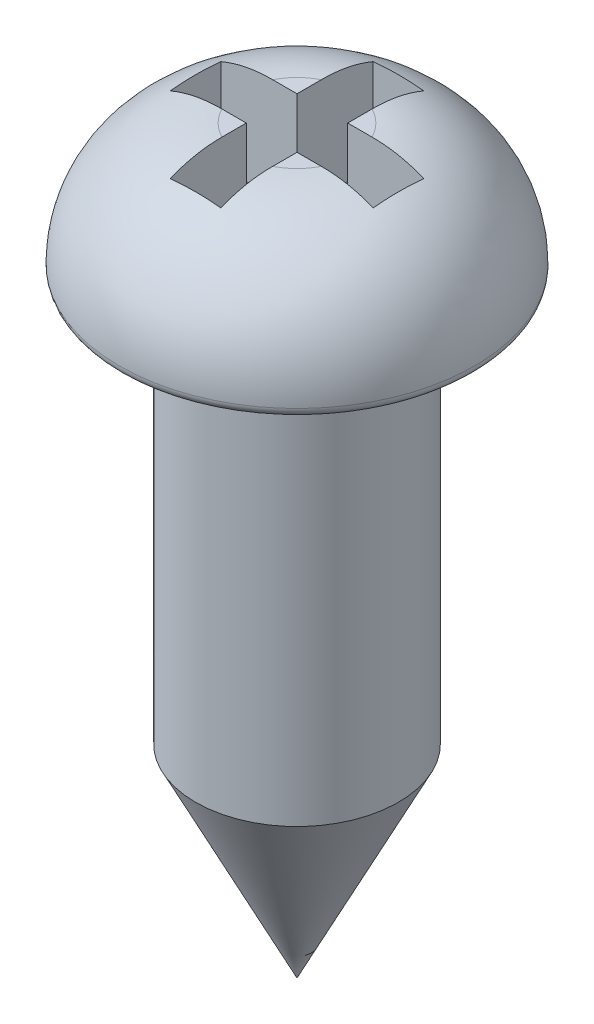
ISO-10303-21;
HEADER;
FILE_DESCRIPTION(('STEP AP214'),'2;1');
FILE_NAME('part.step','',(''),(''),'','','');
FILE_SCHEMA(('AUTOMOTIVE_DESIGN { 1 0 10303 214 1 1 1 1 }'));
ENDSEC;
DATA;
#1=APPLICATION_CONTEXT('core data for automotive mechanical design processes');
#2=APPLICATION_PROTOCOL_DEFINITION('international standard','automotive_design',2000,#1);
#3=PRODUCT_CONTEXT('',#1,'mechanical');
#4=PRODUCT('Part','Part','',(#3));
#5=PRODUCT_RELATED_PRODUCT_CATEGORY('part','',(#4));
#6=PRODUCT_DEFINITION_FORMATION('','',#4);
#7=PRODUCT_DEFINITION_CONTEXT('part definition',#1,'design');
#8=PRODUCT_DEFINITION('design','',#6,#7);
#9=PRODUCT_DEFINITION_SHAPE('','',#8);
#10=(LENGTH_UNIT() NAMED_UNIT(*) SI_UNIT(.MILLI.,.METRE.));
#11=(NAMED_UNIT(*) PLANE_ANGLE_UNIT() SI_UNIT($,.RADIAN.));
#12=(NAMED_UNIT(*) SI_UNIT($,.STERADIAN.) SOLID_ANGLE_UNIT());
#13=UNCERTAINTY_MEASURE_WITH_UNIT(LENGTH_MEASURE(1.E-05),#10,'distance_accuracy_value','');
#14=(GEOMETRIC_REPRESENTATION_CONTEXT(3) GLOBAL_UNCERTAINTY_ASSIGNED_CONTEXT((#13)) GLOBAL_UNIT_ASSIGNED_CONTEXT((#10,
#11,#12)) REPRESENTATION_CONTEXT('',''));
#15=CARTESIAN_POINT('',(0.,0.,0.));
#16=DIRECTION('',(0.,0.,1.));
#17=DIRECTION('',(1.,0.,0.));
#18=AXIS2_PLACEMENT_3D('',#15,#16,#17);
#19=CARTESIAN_POINT('',(0.,7.3,0.));
#20=DIRECTION('',(0.,1.,0.));
#21=DIRECTION('',(0.,0.,1.));
#22=AXIS2_PLACEMENT_3D('',#19,#20,#21);
#23=PLANE('',#22);
#24=DIRECTION('',(-1.,0.,0.));
#25=VECTOR('',#24,1.);
#26=CARTESIAN_POINT('',(1.,7.3,-0.25));
#27=LINE('',#26,#25);
#28=CARTESIAN_POINT('',(0.489897948556636,7.3,-0.25));
#29=VERTEX_POINT('',#28);
#30=CARTESIAN_POINT('',(0.25,7.3,-0.25));
#31=VERTEX_POINT('',#30);
#32=EDGE_CURVE('E196',#29,#31,#27,.T.);
#33=ORIENTED_EDGE('',*,*,#32,.F.);
#34=CARTESIAN_POINT('',(0.,7.3,0.));
#35=DIRECTION('',(0.,1.,0.));
#36=DIRECTION('',(0.,0.,1.));
#37=AXIS2_PLACEMENT_3D('',#34,#35,#36);
#38=CIRCLE('',#37,0.55);
#39=CARTESIAN_POINT('',(0.25,7.3,-0.489897948556636));
#40=VERTEX_POINT('',#39);
#41=EDGE_CURVE('E251',#29,#40,#38,.T.);
#42=ORIENTED_EDGE('',*,*,#41,.T.);
#43=DIRECTION('',(0.,0.,-1.));
#44=VECTOR('',#43,1.);
#45=CARTESIAN_POINT('',(0.25,7.3,-0.25));
#46=LINE('',#45,#44);
#47=EDGE_CURVE('E198',#31,#40,#46,.T.);
#48=ORIENTED_EDGE('',*,*,#47,.F.);
#49=EDGE_LOOP('',(#33,#42,#48));
#50=FACE_BOUND('',#49,.T.);
#51=ADVANCED_FACE('F32',(#50),#23,.T.);
#52=DIRECTION('',(0.,0.,1.));
#53=VECTOR('',#52,1.);
#54=CARTESIAN_POINT('',(-0.25,7.3,-0.25));
#55=LINE('',#54,#53);
#56=CARTESIAN_POINT('',(-0.25,7.3,-0.489897948556636));
#57=VERTEX_POINT('',#56);
#58=CARTESIAN_POINT('',(-0.25,7.3,-0.25));
#59=VERTEX_POINT('',#58);
#60=EDGE_CURVE('E201',#57,#59,#55,.T.);
#61=ORIENTED_EDGE('',*,*,#60,.F.);
#62=CARTESIAN_POINT('',(0.,7.3,0.));
#63=DIRECTION('',(0.,1.,0.));
#64=DIRECTION('',(0.,0.,1.));
#65=AXIS2_PLACEMENT_3D('',#62,#63,#64);
#66=CIRCLE('',#65,0.55);
#67=CARTESIAN_POINT('',(-0.489897948556636,7.3,-0.25));
#68=VERTEX_POINT('',#67);
#69=EDGE_CURVE('E249',#57,#68,#66,.T.);
#70=ORIENTED_EDGE('',*,*,#69,.T.);
#71=DIRECTION('',(-1.,0.,0.));
#72=VECTOR('',#71,1.);
#73=CARTESIAN_POINT('',(-1.,7.3,-0.25));
#74=LINE('',#73,#72);
#75=EDGE_CURVE('E203',#59,#68,#74,.T.);
#76=ORIENTED_EDGE('',*,*,#75,.F.);
#77=EDGE_LOOP('',(#61,#70,#76));
#78=FACE_BOUND('',#77,.T.);
#79=ADVANCED_FACE('F428',(#78),#23,.T.);
#80=DIRECTION('',(1.,0.,0.));
#81=VECTOR('',#80,1.);
#82=CARTESIAN_POINT('',(-1.,7.3,0.25));
#83=LINE('',#82,#81);
#84=CARTESIAN_POINT('',(-0.489897948556636,7.3,0.25));
#85=VERTEX_POINT('',#84);
#86=CARTESIAN_POINT('',(-0.25,7.3,0.25));
#87=VERTEX_POINT('',#86);
#88=EDGE_CURVE('E206',#85,#87,#83,.T.);
#89=ORIENTED_EDGE('',*,*,#88,.F.);
#90=CARTESIAN_POINT('',(0.,7.3,0.));
#91=DIRECTION('',(0.,1.,0.));
#92=DIRECTION('',(0.,0.,1.));
#93=AXIS2_PLACEMENT_3D('',#90,#91,#92);
#94=CIRCLE('',#93,0.55);
#95=CARTESIAN_POINT('',(-0.25,7.3,0.489897948556636));
#96=VERTEX_POINT('',#95);
#97=EDGE_CURVE('E247',#85,#96,#94,.T.);
#98=ORIENTED_EDGE('',*,*,#97,.T.);
#99=DIRECTION('',(0.,0.,1.));
#100=VECTOR('',#99,1.);
#101=CARTESIAN_POINT('',(-0.25,7.3,0.25));
#102=LINE('',#101,#100);
#103=EDGE_CURVE('E208',#87,#96,#102,.T.);
#104=ORIENTED_EDGE('',*,*,#103,.F.);
#105=EDGE_LOOP('',(#89,#98,#104));
#106=FACE_BOUND('',#105,.T.);
#107=ADVANCED_FACE('F433',(#106),#23,.T.);
#108=CARTESIAN_POINT('',(0.,6.,0.));
#109=DIRECTION('',(0.,-1.,0.));
#110=DIRECTION('',(0.,0.,-1.));
#111=AXIS2_PLACEMENT_3D('',#108,#109,#110);
#112=CYLINDRICAL_SURFACE('',#111,1.);
#113=CARTESIAN_POINT('',(0.,2.00000000000001,0.));
#114=DIRECTION('',(0.,1.,0.));
#115=DIRECTION('',(0.,0.,1.));
#116=AXIS2_PLACEMENT_3D('',#113,#114,#115);
#117=CIRCLE('',#116,1.);
#118=CARTESIAN_POINT('',(0.,2.00000000000001,1.));
#119=VERTEX_POINT('',#118);
#120=EDGE_CURVE('E11',#119,#119,#117,.T.);
#121=ORIENTED_EDGE('',*,*,#120,.T.);
#122=EDGE_LOOP('',(#121));
#123=FACE_BOUND('',#122,.T.);
#124=CARTESIAN_POINT('',(0.,6.,0.));
#125=DIRECTION('',(0.,1.,0.));
#126=DIRECTION('',(0.,0.,1.));
#127=AXIS2_PLACEMENT_3D('',#124,#125,#126);
#128=CIRCLE('',#127,1.);
#129=CARTESIAN_POINT('',(0.,6.,1.));
#130=VERTEX_POINT('',#129);
#131=EDGE_CURVE('E214',#130,#130,#128,.T.);
#132=ORIENTED_EDGE('',*,*,#131,.F.);
#133=EDGE_LOOP('',(#132));
#134=FACE_BOUND('',#133,.T.);
#135=ADVANCED_FACE('F435',(#123,#134),#112,.T.);
#136=DIRECTION('',(0.,0.,-1.));
#137=VECTOR('',#136,1.);
#138=CARTESIAN_POINT('',(0.25,7.3,0.25));
#139=LINE('',#138,#137);
#140=CARTESIAN_POINT('',(0.25,7.3,0.489897948556636));
#141=VERTEX_POINT('',#140);
#142=CARTESIAN_POINT('',(0.25,7.3,0.25));
#143=VERTEX_POINT('',#142);
#144=EDGE_CURVE('E168',#141,#143,#139,.T.);
#145=ORIENTED_EDGE('',*,*,#144,.F.);
#146=CARTESIAN_POINT('',(0.,7.3,0.));
#147=DIRECTION('',(0.,1.,0.));
#148=DIRECTION('',(0.,0.,1.));
#149=AXIS2_PLACEMENT_3D('',#146,#147,#148);
#150=CIRCLE('',#149,0.55);
#151=CARTESIAN_POINT('',(0.489897948556636,7.3,0.25));
#152=VERTEX_POINT('',#151);
#153=EDGE_CURVE('E245',#141,#152,#150,.T.);
#154=ORIENTED_EDGE('',*,*,#153,.T.);
#155=DIRECTION('',(1.,0.,0.));
#156=VECTOR('',#155,1.);
#157=CARTESIAN_POINT('',(1.,7.3,0.25));
#158=LINE('',#157,#156);
#159=EDGE_CURVE('E165',#143,#152,#158,.T.);
#160=ORIENTED_EDGE('',*,*,#159,.F.);
#161=EDGE_LOOP('',(#145,#154,#160));
#162=FACE_BOUND('',#161,.T.);
#163=ADVANCED_FACE('F358',(#162),#23,.T.);
#164=CARTESIAN_POINT('',(0.,6.,0.));
#165=DIRECTION('',(0.,1.,0.));
#166=DIRECTION('',(0.,0.,1.));
#167=AXIS2_PLACEMENT_3D('',#164,#165,#166);
#168=PLANE('',#167);
#169=CARTESIAN_POINT('',(0.,6.,0.));
#170=DIRECTION('',(0.,1.,0.));
#171=DIRECTION('',(0.,0.,1.));
#172=AXIS2_PLACEMENT_3D('',#169,#170,#171);
#173=CIRCLE('',#172,1.65);
#174=CARTESIAN_POINT('',(0.,6.,1.65));
#175=VERTEX_POINT('',#174);
#176=EDGE_CURVE('E41',#175,#175,#173,.F.);
#177=ORIENTED_EDGE('',*,*,#176,.T.);
#178=EDGE_LOOP('',(#177));
#179=FACE_BOUND('',#178,.T.);
#180=ORIENTED_EDGE('',*,*,#131,.T.);
#181=EDGE_LOOP('',(#180));
#182=FACE_BOUND('',#181,.T.);
#183=ADVANCED_FACE('F303',(#179,#182),#168,.F.);
#184=CARTESIAN_POINT('',(1.,6.3,0.25));
#185=DIRECTION('',(1.,0.,0.));
#186=DIRECTION('',(0.,0.,-1.));
#187=AXIS2_PLACEMENT_3D('',#184,#185,#186);
#188=PLANE('',#187);
#189=DIRECTION('',(0.,1.,0.));
#190=VECTOR('',#189,1.);
#191=CARTESIAN_POINT('',(1.,6.3,0.25));
#192=LINE('',#191,#190);
#193=CARTESIAN_POINT('',(1.,6.3,0.25));
#194=VERTEX_POINT('',#193);
#195=CARTESIAN_POINT('',(1.,7.19947898890559,0.25));
#196=VERTEX_POINT('',#195);
#197=EDGE_CURVE('E212',#194,#196,#192,.T.);
#198=ORIENTED_EDGE('',*,*,#197,.T.);
#199=CARTESIAN_POINT('',(1.,7.19947898890559,0.25));
#200=CARTESIAN_POINT('',(1.,7.2038672817931,0.208429115066228));
#201=CARTESIAN_POINT('',(1.,7.2071077752232,0.166744443453336));
#202=CARTESIAN_POINT('',(1.,7.2113860901814,0.0833729791125031));
#203=CARTESIAN_POINT('',(1.,7.21242977307177,0.0416864895562515));
#204=CARTESIAN_POINT('',(1.,7.21242977307177,-0.0416864895562517));
#205=CARTESIAN_POINT('',(1.,7.2113860901814,-0.0833729791125033));
#206=CARTESIAN_POINT('',(1.,7.2071077752232,-0.166744443453336));
#207=CARTESIAN_POINT('',(1.,7.2038672817931,-0.208429115066228));
#208=CARTESIAN_POINT('',(1.,7.19947898890559,-0.25));
#209=B_SPLINE_CURVE_WITH_KNOTS('',3,(#199,#200,#201,#202,#203,#204,#205,#206,#207,#208),
.UNSPECIFIED.,.F.,.F.,(4,2,2,2,4),(0.,0.125378347372721,0.250421743542603,0.375465139712485,
0.500843487085207),.UNSPECIFIED.);
#210=CARTESIAN_POINT('',(1.,7.19947898890559,-0.25));
#211=VERTEX_POINT('',#210);
#212=EDGE_CURVE('E48',#196,#211,#209,.T.);
#213=ORIENTED_EDGE('',*,*,#212,.T.);
#214=DIRECTION('',(0.,1.,0.));
#215=VECTOR('',#214,1.);
#216=CARTESIAN_POINT('',(1.,6.3,-0.25));
#217=LINE('',#216,#215);
#218=CARTESIAN_POINT('',(1.,6.3,-0.25));
#219=VERTEX_POINT('',#218);
#220=EDGE_CURVE('E142',#219,#211,#217,.T.);
#221=ORIENTED_EDGE('',*,*,#220,.F.);
#222=DIRECTION('',(0.,0.,-1.));
#223=VECTOR('',#222,1.);
#224=CARTESIAN_POINT('',(1.,6.3,0.25));
#225=LINE('',#224,#223);
#226=EDGE_CURVE('E146',#194,#219,#225,.T.);
#227=ORIENTED_EDGE('',*,*,#226,.F.);
#228=EDGE_LOOP('',(#198,#213,#221,#227));
#229=FACE_BOUND('',#228,.T.);
#230=ADVANCED_FACE('F144',(#229),#188,.F.);
#231=CARTESIAN_POINT('',(1.,6.3,0.25));
#232=DIRECTION('',(0.,0.,1.));
#233=DIRECTION('',(1.,0.,0.));
#234=AXIS2_PLACEMENT_3D('',#231,#232,#233);
#235=PLANE('',#234);
#236=ORIENTED_EDGE('',*,*,#159,.T.);
#237=CARTESIAN_POINT('',(0.489897948556636,7.3,0.25));
#238=CARTESIAN_POINT('',(0.528465567779991,7.30003087432047,0.25));
#239=CARTESIAN_POINT('',(0.567053426634908,7.29852184387146,0.25));
#240=CARTESIAN_POINT('',(0.644010025722312,7.29225371904953,0.25));
#241=CARTESIAN_POINT('',(0.682378432769481,7.28749057481186,0.25));
#242=CARTESIAN_POINT('',(0.757844991790654,7.27466100899481,0.25));
#243=CARTESIAN_POINT('',(0.794953550683729,7.26665635514836,0.25));
#244=CARTESIAN_POINT('',(0.868267167379806,7.24733337940957,0.25));
#245=CARTESIAN_POINT('',(0.904473019644371,7.23601809155035,0.25));
#246=CARTESIAN_POINT('',(0.960254767985434,7.21572864592542,0.25));
#247=CARTESIAN_POINT('',(0.980239349722968,7.20786423878571,0.25));
#248=CARTESIAN_POINT('',(1.,7.19947898890559,0.25));
#249=B_SPLINE_CURVE_WITH_KNOTS('',3,(#237,#238,#239,#240,#241,#242,#243,#244,#245,#246,#247,
#248),.UNSPECIFIED.,.F.,.F.,(4,2,2,2,2,4),(0.,0.115701692153302,0.231547642276667,
0.34528285232074,0.458914154396708,0.523313130280762),.UNSPECIFIED.);
#250=EDGE_CURVE('E361',#152,#196,#249,.T.);
#251=ORIENTED_EDGE('',*,*,#250,.T.);
#252=ORIENTED_EDGE('',*,*,#197,.F.);
#253=DIRECTION('',(1.,0.,0.));
#254=VECTOR('',#253,1.);
#255=CARTESIAN_POINT('',(1.,6.3,0.25));
#256=LINE('',#255,#254);
#257=CARTESIAN_POINT('',(0.25,6.3,0.25));
#258=VERTEX_POINT('',#257);
#259=EDGE_CURVE('E151',#258,#194,#256,.T.);
#260=ORIENTED_EDGE('',*,*,#259,.F.);
#261=DIRECTION('',(0.,1.,0.));
#262=VECTOR('',#261,1.);
#263=CARTESIAN_POINT('',(0.25,6.3,0.25));
#264=LINE('',#263,#262);
#265=EDGE_CURVE('E215',#258,#143,#264,.T.);
#266=ORIENTED_EDGE('',*,*,#265,.T.);
#267=EDGE_LOOP('',(#236,#251,#252,#260,#266));
#268=FACE_BOUND('',#267,.T.);
#269=ADVANCED_FACE('F355',(#268),#235,.F.);
#270=CARTESIAN_POINT('',(0.25,6.3,0.25));
#271=DIRECTION('',(1.,0.,0.));
#272=DIRECTION('',(0.,0.,-1.));
#273=AXIS2_PLACEMENT_3D('',#270,#271,#272);
#274=PLANE('',#273);
#275=DIRECTION('',(0.,1.,0.));
#276=VECTOR('',#275,1.);
#277=CARTESIAN_POINT('',(0.25,6.3,1.));
#278=LINE('',#277,#276);
#279=CARTESIAN_POINT('',(0.25,6.3,1.));
#280=VERTEX_POINT('',#279);
#281=CARTESIAN_POINT('',(0.25,7.19947898890559,1.));
#282=VERTEX_POINT('',#281);
#283=EDGE_CURVE('E218',#280,#282,#278,.T.);
#284=ORIENTED_EDGE('',*,*,#283,.T.);
#285=CARTESIAN_POINT('',(0.25,7.19947898890559,1.));
#286=CARTESIAN_POINT('',(0.25,7.21332856340117,0.967371790492445));
#287=CARTESIAN_POINT('',(0.25,7.22574935942083,0.934142584273237));
#288=CARTESIAN_POINT('',(0.25,7.24770994761751,0.866749954573404));
#289=CARTESIAN_POINT('',(0.25,7.25725016415819,0.83258666950969));
#290=CARTESIAN_POINT('',(0.25,7.27330568614717,0.764115075080422));
#291=CARTESIAN_POINT('',(0.25,7.27986530225913,0.729817096691054));
#292=CARTESIAN_POINT('',(0.25,7.29021340951546,0.660819308016827));
#293=CARTESIAN_POINT('',(0.25,7.29400304412084,0.626119669555086));
#294=CARTESIAN_POINT('',(0.25,7.29766085452818,0.574488252007693));
#295=CARTESIAN_POINT('',(0.25,7.2985434863946,0.557621529137467));
#296=CARTESIAN_POINT('',(0.25,7.29971475966734,0.523802853831338));
#297=CARTESIAN_POINT('',(0.25,7.30000112087098,0.506850821819629));
#298=CARTESIAN_POINT('',(0.25,7.3,0.489897948556636));
#299=B_SPLINE_CURVE_WITH_KNOTS('',3,(#285,#286,#287,#288,#289,#290,#291,#292,#293,#294,#295,
#296,#297,#298),.UNSPECIFIED.,.F.,.F.,(4,2,2,2,2,2,4),(0.,0.106297281508825,0.212578895775245,
0.317224178266602,0.421826238273105,0.472486790713205,0.523340721362817),.UNSPECIFIED.);
#300=EDGE_CURVE('E360',#282,#141,#299,.T.);
#301=ORIENTED_EDGE('',*,*,#300,.T.);
#302=ORIENTED_EDGE('',*,*,#144,.T.);
#303=ORIENTED_EDGE('',*,*,#265,.F.);
#304=DIRECTION('',(0.,0.,-1.));
#305=VECTOR('',#304,1.);
#306=CARTESIAN_POINT('',(0.25,6.3,0.25));
#307=LINE('',#306,#305);
#308=EDGE_CURVE('E193',#280,#258,#307,.T.);
#309=ORIENTED_EDGE('',*,*,#308,.F.);
#310=EDGE_LOOP('',(#284,#301,#302,#303,#309));
#311=FACE_BOUND('',#310,.T.);
#312=ADVANCED_FACE('F351',(#311),#274,.F.);
#313=CARTESIAN_POINT('',(-0.25,6.3,1.));
#314=DIRECTION('',(0.,0.,1.));
#315=DIRECTION('',(1.,0.,0.));
#316=AXIS2_PLACEMENT_3D('',#313,#314,#315);
#317=PLANE('',#316);
#318=DIRECTION('',(0.,1.,0.));
#319=VECTOR('',#318,1.);
#320=CARTESIAN_POINT('',(-0.25,6.3,1.));
#321=LINE('',#320,#319);
#322=CARTESIAN_POINT('',(-0.25,6.3,1.));
#323=VERTEX_POINT('',#322);
#324=CARTESIAN_POINT('',(-0.25,7.19947898890559,1.));
#325=VERTEX_POINT('',#324);
#326=EDGE_CURVE('E221',#323,#325,#321,.T.);
#327=ORIENTED_EDGE('',*,*,#326,.T.);
#328=CARTESIAN_POINT('',(-0.25,7.19947898890559,1.));
#329=CARTESIAN_POINT('',(-0.208429115066227,7.2038672817931,1.));
#330=CARTESIAN_POINT('',(-0.166744443453335,7.2071077752232,1.));
#331=CARTESIAN_POINT('',(-0.0833729791125031,7.2113860901814,1.));
#332=CARTESIAN_POINT('',(-0.0416864895562516,7.21242977307177,1.));
#333=CARTESIAN_POINT('',(0.0416864895562515,7.21242977307177,1.));
#334=CARTESIAN_POINT('',(0.0833729791125031,7.2113860901814,1.));
#335=CARTESIAN_POINT('',(0.166744443453335,7.2071077752232,1.));
#336=CARTESIAN_POINT('',(0.208429115066227,7.2038672817931,1.));
#337=CARTESIAN_POINT('',(0.25,7.19947898890559,1.));
#338=B_SPLINE_CURVE_WITH_KNOTS('',3,(#328,#329,#330,#331,#332,#333,#334,#335,#336,#337),
.UNSPECIFIED.,.F.,.F.,(4,2,2,2,4),(0.,0.125378347372721,0.250421743542603,0.375465139712485,
0.500843487085206),.UNSPECIFIED.);
#339=EDGE_CURVE('E348',#325,#282,#338,.T.);
#340=ORIENTED_EDGE('',*,*,#339,.T.);
#341=ORIENTED_EDGE('',*,*,#283,.F.);
#342=DIRECTION('',(1.,0.,0.));
#343=VECTOR('',#342,1.);
#344=CARTESIAN_POINT('',(-0.25,6.3,1.));
#345=LINE('',#344,#343);
#346=EDGE_CURVE('E190',#323,#280,#345,.T.);
#347=ORIENTED_EDGE('',*,*,#346,.F.);
#348=EDGE_LOOP('',(#327,#340,#341,#347));
#349=FACE_BOUND('',#348,.T.);
#350=ADVANCED_FACE('F346',(#349),#317,.F.);
#351=CARTESIAN_POINT('',(-0.25,6.3,0.25));
#352=DIRECTION('',(-1.,0.,0.));
#353=DIRECTION('',(0.,0.,1.));
#354=AXIS2_PLACEMENT_3D('',#351,#352,#353);
#355=PLANE('',#354);
#356=ORIENTED_EDGE('',*,*,#103,.T.);
#357=CARTESIAN_POINT('',(-0.25,7.3,0.489897948556636));
#358=CARTESIAN_POINT('',(-0.25,7.30003087432047,0.528465567779991));
#359=CARTESIAN_POINT('',(-0.25,7.29852184387146,0.567053426634908));
#360=CARTESIAN_POINT('',(-0.25,7.29225371904953,0.644010025722312));
#361=CARTESIAN_POINT('',(-0.25,7.28749057481186,0.682378432769481));
#362=CARTESIAN_POINT('',(-0.25,7.27466100899481,0.757844991790654));
#363=CARTESIAN_POINT('',(-0.25,7.26665635514836,0.794953550683729));
#364=CARTESIAN_POINT('',(-0.25,7.24733337940957,0.868267167379806));
#365=CARTESIAN_POINT('',(-0.25,7.23601809155035,0.904473019644371));
#366=CARTESIAN_POINT('',(-0.25,7.21572864592542,0.960254767985434));
#367=CARTESIAN_POINT('',(-0.25,7.20786423878571,0.980239349722968));
#368=CARTESIAN_POINT('',(-0.25,7.19947898890559,1.));
#369=B_SPLINE_CURVE_WITH_KNOTS('',3,(#357,#358,#359,#360,#361,#362,#363,#364,#365,#366,#367,
#368),.UNSPECIFIED.,.F.,.F.,(4,2,2,2,2,4),(0.,0.115701692153302,0.231547642276666,
0.34528285232074,0.458914154396708,0.523313130280762),.UNSPECIFIED.);
#370=EDGE_CURVE('E390',#96,#325,#369,.T.);
#371=ORIENTED_EDGE('',*,*,#370,.T.);
#372=ORIENTED_EDGE('',*,*,#326,.F.);
#373=DIRECTION('',(0.,0.,1.));
#374=VECTOR('',#373,1.);
#375=CARTESIAN_POINT('',(-0.25,6.3,0.25));
#376=LINE('',#375,#374);
#377=CARTESIAN_POINT('',(-0.25,6.3,0.25));
#378=VERTEX_POINT('',#377);
#379=EDGE_CURVE('E187',#378,#323,#376,.T.);
#380=ORIENTED_EDGE('',*,*,#379,.F.);
#381=DIRECTION('',(0.,1.,0.));
#382=VECTOR('',#381,1.);
#383=CARTESIAN_POINT('',(-0.25,6.3,0.25));
#384=LINE('',#383,#382);
#385=EDGE_CURVE('E224',#378,#87,#384,.T.);
#386=ORIENTED_EDGE('',*,*,#385,.T.);
#387=EDGE_LOOP('',(#356,#371,#372,#380,#386));
#388=FACE_BOUND('',#387,.T.);
#389=ADVANCED_FACE('F342',(#388),#355,.F.);
#390=CARTESIAN_POINT('',(-1.,6.3,0.25));
#391=DIRECTION('',(0.,0.,1.));
#392=DIRECTION('',(1.,0.,0.));
#393=AXIS2_PLACEMENT_3D('',#390,#391,#392);
#394=PLANE('',#393);
#395=DIRECTION('',(0.,1.,0.));
#396=VECTOR('',#395,1.);
#397=CARTESIAN_POINT('',(-1.,6.3,0.25));
#398=LINE('',#397,#396);
#399=CARTESIAN_POINT('',(-1.,6.3,0.25));
#400=VERTEX_POINT('',#399);
#401=CARTESIAN_POINT('',(-1.,7.19947898890559,0.25));
#402=VERTEX_POINT('',#401);
#403=EDGE_CURVE('E227',#400,#402,#398,.T.);
#404=ORIENTED_EDGE('',*,*,#403,.T.);
#405=CARTESIAN_POINT('',(-1.,7.19947898890559,0.25));
#406=CARTESIAN_POINT('',(-0.967371790492445,7.21332856340117,0.25));
#407=CARTESIAN_POINT('',(-0.934142584273237,7.22574935942083,0.25));
#408=CARTESIAN_POINT('',(-0.866749954573404,7.24770994761751,0.25));
#409=CARTESIAN_POINT('',(-0.83258666950969,7.25725016415819,0.25));
#410=CARTESIAN_POINT('',(-0.764115075080422,7.27330568614717,0.25));
#411=CARTESIAN_POINT('',(-0.729817096691054,7.27986530225913,0.25));
#412=CARTESIAN_POINT('',(-0.660819308016827,7.29021340951546,0.25));
#413=CARTESIAN_POINT('',(-0.626119669555086,7.29400304412084,0.25));
#414=CARTESIAN_POINT('',(-0.574488252007693,7.29766085452818,0.25));
#415=CARTESIAN_POINT('',(-0.557621529137467,7.2985434863946,0.25));
#416=CARTESIAN_POINT('',(-0.523802853831338,7.29971475966734,0.25));
#417=CARTESIAN_POINT('',(-0.506850821819629,7.30000112087098,0.25));
#418=CARTESIAN_POINT('',(-0.489897948556636,7.3,0.25));
#419=B_SPLINE_CURVE_WITH_KNOTS('',3,(#405,#406,#407,#408,#409,#410,#411,#412,#413,#414,#415,
#416,#417,#418),.UNSPECIFIED.,.F.,.F.,(4,2,2,2,2,2,4),(0.,0.106297281508825,0.212578895775245,
0.317224178266602,0.421826238273105,0.472486790713205,0.523340721362817),.UNSPECIFIED.);
#420=EDGE_CURVE('E396',#402,#85,#419,.T.);
#421=ORIENTED_EDGE('',*,*,#420,.T.);
#422=ORIENTED_EDGE('',*,*,#88,.T.);
#423=ORIENTED_EDGE('',*,*,#385,.F.);
#424=DIRECTION('',(1.,0.,0.));
#425=VECTOR('',#424,1.);
#426=CARTESIAN_POINT('',(-1.,6.3,0.25));
#427=LINE('',#426,#425);
#428=EDGE_CURVE('E184',#400,#378,#427,.T.);
#429=ORIENTED_EDGE('',*,*,#428,.F.);
#430=EDGE_LOOP('',(#404,#421,#422,#423,#429));
#431=FACE_BOUND('',#430,.T.);
#432=ADVANCED_FACE('F337',(#431),#394,.F.);
#433=CARTESIAN_POINT('',(-1.,6.3,0.25));
#434=DIRECTION('',(-1.,0.,0.));
#435=DIRECTION('',(0.,0.,1.));
#436=AXIS2_PLACEMENT_3D('',#433,#434,#435);
#437=PLANE('',#436);
#438=DIRECTION('',(0.,1.,0.));
#439=VECTOR('',#438,1.);
#440=CARTESIAN_POINT('',(-1.,6.3,-0.25));
#441=LINE('',#440,#439);
#442=CARTESIAN_POINT('',(-1.,6.3,-0.25));
#443=VERTEX_POINT('',#442);
#444=CARTESIAN_POINT('',(-1.,7.19947898890559,-0.25));
#445=VERTEX_POINT('',#444);
#446=EDGE_CURVE('E230',#443,#445,#441,.T.);
#447=ORIENTED_EDGE('',*,*,#446,.T.);
#448=CARTESIAN_POINT('',(-1.,7.19947898890559,-0.25));
#449=CARTESIAN_POINT('',(-1.,7.2038672817931,-0.208429115066228));
#450=CARTESIAN_POINT('',(-1.,7.2071077752232,-0.166744443453336));
#451=CARTESIAN_POINT('',(-1.,7.2113860901814,-0.0833729791125031));
#452=CARTESIAN_POINT('',(-1.,7.21242977307177,-0.0416864895562515));
#453=CARTESIAN_POINT('',(-1.,7.21242977307177,0.0416864895562517));
#454=CARTESIAN_POINT('',(-1.,7.2113860901814,0.0833729791125033));
#455=CARTESIAN_POINT('',(-1.,7.2071077752232,0.166744443453336));
#456=CARTESIAN_POINT('',(-1.,7.2038672817931,0.208429115066228));
#457=CARTESIAN_POINT('',(-1.,7.19947898890559,0.25));
#458=B_SPLINE_CURVE_WITH_KNOTS('',3,(#448,#449,#450,#451,#452,#453,#454,#455,#456,#457),
.UNSPECIFIED.,.F.,.F.,(4,2,2,2,4),(0.,0.125378347372721,0.250421743542603,0.375465139712485,
0.500843487085207),.UNSPECIFIED.);
#459=EDGE_CURVE('E334',#445,#402,#458,.T.);
#460=ORIENTED_EDGE('',*,*,#459,.T.);
#461=ORIENTED_EDGE('',*,*,#403,.F.);
#462=DIRECTION('',(0.,0.,1.));
#463=VECTOR('',#462,1.);
#464=CARTESIAN_POINT('',(-1.,6.3,0.25));
#465=LINE('',#464,#463);
#466=EDGE_CURVE('E181',#443,#400,#465,.T.);
#467=ORIENTED_EDGE('',*,*,#466,.F.);
#468=EDGE_LOOP('',(#447,#460,#461,#467));
#469=FACE_BOUND('',#468,.T.);
#470=ADVANCED_FACE('F332',(#469),#437,.F.);
#471=CARTESIAN_POINT('',(-1.,6.3,-0.25));
#472=DIRECTION('',(0.,0.,-1.));
#473=DIRECTION('',(-1.,0.,0.));
#474=AXIS2_PLACEMENT_3D('',#471,#472,#473);
#475=PLANE('',#474);
#476=ORIENTED_EDGE('',*,*,#75,.T.);
#477=CARTESIAN_POINT('',(-0.489897948556636,7.3,-0.25));
#478=CARTESIAN_POINT('',(-0.528465567779991,7.30003087432047,-0.25));
#479=CARTESIAN_POINT('',(-0.567053426634908,7.29852184387146,-0.25));
#480=CARTESIAN_POINT('',(-0.644010025722312,7.29225371904953,-0.25));
#481=CARTESIAN_POINT('',(-0.682378432769481,7.28749057481186,-0.25));
#482=CARTESIAN_POINT('',(-0.757844991790654,7.27466100899481,-0.25));
#483=CARTESIAN_POINT('',(-0.794953550683729,7.26665635514836,-0.25));
#484=CARTESIAN_POINT('',(-0.868267167379806,7.24733337940957,-0.25));
#485=CARTESIAN_POINT('',(-0.904473019644371,7.23601809155035,-0.25));
#486=CARTESIAN_POINT('',(-0.960254767985434,7.21572864592542,-0.25));
#487=CARTESIAN_POINT('',(-0.980239349722968,7.20786423878571,-0.25));
#488=CARTESIAN_POINT('',(-1.,7.19947898890559,-0.25));
#489=B_SPLINE_CURVE_WITH_KNOTS('',3,(#477,#478,#479,#480,#481,#482,#483,#484,#485,#486,#487,
#488),.UNSPECIFIED.,.F.,.F.,(4,2,2,2,2,4),(0.,0.115701692153302,0.231547642276667,
0.34528285232074,0.458914154396708,0.523313130280762),.UNSPECIFIED.);
#490=EDGE_CURVE('E416',#68,#445,#489,.T.);
#491=ORIENTED_EDGE('',*,*,#490,.T.);
#492=ORIENTED_EDGE('',*,*,#446,.F.);
#493=DIRECTION('',(-1.,0.,0.));
#494=VECTOR('',#493,1.);
#495=CARTESIAN_POINT('',(-1.,6.3,-0.25));
#496=LINE('',#495,#494);
#497=CARTESIAN_POINT('',(-0.25,6.3,-0.25));
#498=VERTEX_POINT('',#497);
#499=EDGE_CURVE('E178',#498,#443,#496,.T.);
#500=ORIENTED_EDGE('',*,*,#499,.F.);
#501=DIRECTION('',(0.,1.,0.));
#502=VECTOR('',#501,1.);
#503=CARTESIAN_POINT('',(-0.25,6.3,-0.25));
#504=LINE('',#503,#502);
#505=EDGE_CURVE('E233',#498,#59,#504,.T.);
#506=ORIENTED_EDGE('',*,*,#505,.T.);
#507=EDGE_LOOP('',(#476,#491,#492,#500,#506));
#508=FACE_BOUND('',#507,.T.);
#509=ADVANCED_FACE('F328',(#508),#475,.F.);
#510=CARTESIAN_POINT('',(-0.25,6.3,-0.25));
#511=DIRECTION('',(-1.,0.,0.));
#512=DIRECTION('',(0.,0.,1.));
#513=AXIS2_PLACEMENT_3D('',#510,#511,#512);
#514=PLANE('',#513);
#515=DIRECTION('',(0.,1.,0.));
#516=VECTOR('',#515,1.);
#517=CARTESIAN_POINT('',(-0.25,6.3,-1.));
#518=LINE('',#517,#516);
#519=CARTESIAN_POINT('',(-0.25,6.3,-1.));
#520=VERTEX_POINT('',#519);
#521=CARTESIAN_POINT('',(-0.25,7.19947898890559,-1.));
#522=VERTEX_POINT('',#521);
#523=EDGE_CURVE('E236',#520,#522,#518,.T.);
#524=ORIENTED_EDGE('',*,*,#523,.T.);
#525=CARTESIAN_POINT('',(-0.25,7.19947898890559,-1.));
#526=CARTESIAN_POINT('',(-0.25,7.21332856340117,-0.967371790492445));
#527=CARTESIAN_POINT('',(-0.25,7.22574935942083,-0.934142584273237));
#528=CARTESIAN_POINT('',(-0.25,7.24770994761751,-0.866749954573404));
#529=CARTESIAN_POINT('',(-0.25,7.25725016415819,-0.83258666950969));
#530=CARTESIAN_POINT('',(-0.25,7.27330568614717,-0.764115075080422));
#531=CARTESIAN_POINT('',(-0.25,7.27986530225913,-0.729817096691054));
#532=CARTESIAN_POINT('',(-0.25,7.29021340951546,-0.660819308016827));
#533=CARTESIAN_POINT('',(-0.25,7.29400304412084,-0.626119669555086));
#534=CARTESIAN_POINT('',(-0.25,7.29766085452818,-0.574488252007693));
#535=CARTESIAN_POINT('',(-0.25,7.2985434863946,-0.557621529137467));
#536=CARTESIAN_POINT('',(-0.25,7.29971475966734,-0.523802853831338));
#537=CARTESIAN_POINT('',(-0.25,7.30000112087098,-0.506850821819629));
#538=CARTESIAN_POINT('',(-0.25,7.3,-0.489897948556636));
#539=B_SPLINE_CURVE_WITH_KNOTS('',3,(#525,#526,#527,#528,#529,#530,#531,#532,#533,#534,#535,
#536,#537,#538),.UNSPECIFIED.,.F.,.F.,(4,2,2,2,2,2,4),(0.,0.106297281508825,0.212578895775245,
0.317224178266602,0.421826238273105,0.472486790713205,0.523340721362817),.UNSPECIFIED.);
#540=EDGE_CURVE('E421',#522,#57,#539,.T.);
#541=ORIENTED_EDGE('',*,*,#540,.T.);
#542=ORIENTED_EDGE('',*,*,#60,.T.);
#543=ORIENTED_EDGE('',*,*,#505,.F.);
#544=DIRECTION('',(0.,0.,1.));
#545=VECTOR('',#544,1.);
#546=CARTESIAN_POINT('',(-0.25,6.3,-0.25));
#547=LINE('',#546,#545);
#548=EDGE_CURVE('E175',#520,#498,#547,.T.);
#549=ORIENTED_EDGE('',*,*,#548,.F.);
#550=EDGE_LOOP('',(#524,#541,#542,#543,#549));
#551=FACE_BOUND('',#550,.T.);
#552=ADVANCED_FACE('F323',(#551),#514,.F.);
#553=CARTESIAN_POINT('',(-0.25,6.3,-1.));
#554=DIRECTION('',(0.,0.,-1.));
#555=DIRECTION('',(-1.,0.,0.));
#556=AXIS2_PLACEMENT_3D('',#553,#554,#555);
#557=PLANE('',#556);
#558=DIRECTION('',(0.,1.,0.));
#559=VECTOR('',#558,1.);
#560=CARTESIAN_POINT('',(0.25,6.3,-1.));
#561=LINE('',#560,#559);
#562=CARTESIAN_POINT('',(0.25,6.3,-1.));
#563=VERTEX_POINT('',#562);
#564=CARTESIAN_POINT('',(0.25,7.19947898890559,-1.));
#565=VERTEX_POINT('',#564);
#566=EDGE_CURVE('E239',#563,#565,#561,.T.);
#567=ORIENTED_EDGE('',*,*,#566,.T.);
#568=CARTESIAN_POINT('',(0.25,7.19947898890559,-1.));
#569=CARTESIAN_POINT('',(0.208429115066227,7.2038672817931,-1.));
#570=CARTESIAN_POINT('',(0.166744443453335,7.2071077752232,-1.));
#571=CARTESIAN_POINT('',(0.0833729791125031,7.2113860901814,-1.));
#572=CARTESIAN_POINT('',(0.0416864895562516,7.21242977307177,-1.));
#573=CARTESIAN_POINT('',(-0.0416864895562515,7.21242977307177,-1.));
#574=CARTESIAN_POINT('',(-0.0833729791125031,7.2113860901814,-1.));
#575=CARTESIAN_POINT('',(-0.166744443453335,7.2071077752232,-1.));
#576=CARTESIAN_POINT('',(-0.208429115066227,7.2038672817931,-1.));
#577=CARTESIAN_POINT('',(-0.25,7.19947898890559,-1.));
#578=B_SPLINE_CURVE_WITH_KNOTS('',3,(#568,#569,#570,#571,#572,#573,#574,#575,#576,#577),
.UNSPECIFIED.,.F.,.F.,(4,2,2,2,4),(0.,0.125378347372721,0.250421743542603,0.375465139712485,
0.500843487085206),.UNSPECIFIED.);
#579=EDGE_CURVE('E262',#565,#522,#578,.T.);
#580=ORIENTED_EDGE('',*,*,#579,.T.);
#581=ORIENTED_EDGE('',*,*,#523,.F.);
#582=DIRECTION('',(-1.,0.,0.));
#583=VECTOR('',#582,1.);
#584=CARTESIAN_POINT('',(-0.25,6.3,-1.));
#585=LINE('',#584,#583);
#586=EDGE_CURVE('E172',#563,#520,#585,.T.);
#587=ORIENTED_EDGE('',*,*,#586,.F.);
#588=EDGE_LOOP('',(#567,#580,#581,#587));
#589=FACE_BOUND('',#588,.T.);
#590=ADVANCED_FACE('F276',(#589),#557,.F.);
#591=CARTESIAN_POINT('',(0.25,6.3,-0.25));
#592=DIRECTION('',(1.,0.,0.));
#593=DIRECTION('',(0.,0.,-1.));
#594=AXIS2_PLACEMENT_3D('',#591,#592,#593);
#595=PLANE('',#594);
#596=ORIENTED_EDGE('',*,*,#47,.T.);
#597=CARTESIAN_POINT('',(0.25,7.3,-0.489897948556636));
#598=CARTESIAN_POINT('',(0.25,7.30003087432047,-0.528465567779991));
#599=CARTESIAN_POINT('',(0.25,7.29852184387146,-0.567053426634908));
#600=CARTESIAN_POINT('',(0.25,7.29225371904953,-0.644010025722312));
#601=CARTESIAN_POINT('',(0.25,7.28749057481186,-0.682378432769481));
#602=CARTESIAN_POINT('',(0.25,7.27466100899481,-0.757844991790654));
#603=CARTESIAN_POINT('',(0.25,7.26665635514836,-0.794953550683729));
#604=CARTESIAN_POINT('',(0.25,7.24733337940957,-0.868267167379806));
#605=CARTESIAN_POINT('',(0.25,7.23601809155035,-0.904473019644371));
#606=CARTESIAN_POINT('',(0.25,7.21572864592542,-0.960254767985434));
#607=CARTESIAN_POINT('',(0.25,7.20786423878571,-0.980239349722968));
#608=CARTESIAN_POINT('',(0.25,7.19947898890559,-1.));
#609=B_SPLINE_CURVE_WITH_KNOTS('',3,(#597,#598,#599,#600,#601,#602,#603,#604,#605,#606,#607,
#608),.UNSPECIFIED.,.F.,.F.,(4,2,2,2,2,4),(0.,0.115701692153302,0.231547642276666,
0.34528285232074,0.458914154396708,0.523313130280762),.UNSPECIFIED.);
#610=EDGE_CURVE('E254',#40,#565,#609,.T.);
#611=ORIENTED_EDGE('',*,*,#610,.T.);
#612=ORIENTED_EDGE('',*,*,#566,.F.);
#613=DIRECTION('',(0.,0.,-1.));
#614=VECTOR('',#613,1.);
#615=CARTESIAN_POINT('',(0.25,6.3,-0.25));
#616=LINE('',#615,#614);
#617=CARTESIAN_POINT('',(0.25,6.3,-0.25));
#618=VERTEX_POINT('',#617);
#619=EDGE_CURVE('E160',#618,#563,#616,.T.);
#620=ORIENTED_EDGE('',*,*,#619,.F.);
#621=DIRECTION('',(0.,1.,0.));
#622=VECTOR('',#621,1.);
#623=CARTESIAN_POINT('',(0.25,6.3,-0.25));
#624=LINE('',#623,#622);
#625=EDGE_CURVE('E150',#618,#31,#624,.T.);
#626=ORIENTED_EDGE('',*,*,#625,.T.);
#627=EDGE_LOOP('',(#596,#611,#612,#620,#626));
#628=FACE_BOUND('',#627,.T.);
#629=ADVANCED_FACE('F272',(#628),#595,.F.);
#630=CARTESIAN_POINT('',(1.,6.3,-0.25));
#631=DIRECTION('',(0.,0.,-1.));
#632=DIRECTION('',(-1.,0.,0.));
#633=AXIS2_PLACEMENT_3D('',#630,#631,#632);
#634=PLANE('',#633);
#635=ORIENTED_EDGE('',*,*,#220,.T.);
#636=CARTESIAN_POINT('',(1.,7.19947898890559,-0.25));
#637=CARTESIAN_POINT('',(0.967371790492445,7.21332856340117,-0.25));
#638=CARTESIAN_POINT('',(0.934142584273237,7.22574935942083,-0.25));
#639=CARTESIAN_POINT('',(0.866749954573404,7.24770994761751,-0.25));
#640=CARTESIAN_POINT('',(0.83258666950969,7.25725016415819,-0.25));
#641=CARTESIAN_POINT('',(0.764115075080422,7.27330568614717,-0.25));
#642=CARTESIAN_POINT('',(0.729817096691054,7.27986530225913,-0.25));
#643=CARTESIAN_POINT('',(0.660819308016827,7.29021340951546,-0.25));
#644=CARTESIAN_POINT('',(0.626119669555086,7.29400304412084,-0.25));
#645=CARTESIAN_POINT('',(0.574488252007693,7.29766085452818,-0.25));
#646=CARTESIAN_POINT('',(0.557621529137467,7.2985434863946,-0.25));
#647=CARTESIAN_POINT('',(0.523802853831338,7.29971475966734,-0.25));
#648=CARTESIAN_POINT('',(0.506850821819629,7.30000112087098,-0.25));
#649=CARTESIAN_POINT('',(0.489897948556636,7.3,-0.25));
#650=B_SPLINE_CURVE_WITH_KNOTS('',3,(#636,#637,#638,#639,#640,#641,#642,#643,#644,#645,#646,
#647,#648,#649),.UNSPECIFIED.,.F.,.F.,(4,2,2,2,2,2,4),(0.,0.106297281508825,0.212578895775245,
0.317224178266602,0.421826238273105,0.472486790713205,0.523340721362817),.UNSPECIFIED.);
#651=EDGE_CURVE('E286',#211,#29,#650,.T.);
#652=ORIENTED_EDGE('',*,*,#651,.T.);
#653=ORIENTED_EDGE('',*,*,#32,.T.);
#654=ORIENTED_EDGE('',*,*,#625,.F.);
#655=DIRECTION('',(-1.,0.,0.));
#656=VECTOR('',#655,1.);
#657=CARTESIAN_POINT('',(1.,6.3,-0.25));
#658=LINE('',#657,#656);
#659=EDGE_CURVE('E154',#219,#618,#658,.T.);
#660=ORIENTED_EDGE('',*,*,#659,.F.);
#661=EDGE_LOOP('',(#635,#652,#653,#654,#660));
#662=FACE_BOUND('',#661,.T.);
#663=ADVANCED_FACE('F155',(#662),#634,.F.);
#664=CARTESIAN_POINT('',(0.,6.3,0.));
#665=DIRECTION('',(0.,1.,0.));
#666=DIRECTION('',(0.,0.,1.));
#667=AXIS2_PLACEMENT_3D('',#664,#665,#666);
#668=PLANE('',#667);
#669=ORIENTED_EDGE('',*,*,#226,.T.);
#670=ORIENTED_EDGE('',*,*,#659,.T.);
#671=ORIENTED_EDGE('',*,*,#619,.T.);
#672=ORIENTED_EDGE('',*,*,#586,.T.);
#673=ORIENTED_EDGE('',*,*,#548,.T.);
#674=ORIENTED_EDGE('',*,*,#499,.T.);
#675=ORIENTED_EDGE('',*,*,#466,.T.);
#676=ORIENTED_EDGE('',*,*,#428,.T.);
#677=ORIENTED_EDGE('',*,*,#379,.T.);
#678=ORIENTED_EDGE('',*,*,#346,.T.);
#679=ORIENTED_EDGE('',*,*,#308,.T.);
#680=ORIENTED_EDGE('',*,*,#259,.T.);
#681=EDGE_LOOP('',(#669,#670,#671,#672,#673,#674,#675,#676,#677,#678,#679,#680));
#682=FACE_BOUND('',#681,.T.);
#683=ADVANCED_FACE('F162',(#682),#668,.T.);
#684=CARTESIAN_POINT('',(0.,6.1,0.));
#685=DIRECTION('',(0.,1.,0.));
#686=DIRECTION('',(0.,0.,1.));
#687=AXIS2_PLACEMENT_3D('',#684,#685,#686);
#688=DEGENERATE_TOROIDAL_SURFACE('',#687,0.55,1.2,.T.);
#689=CARTESIAN_POINT('',(0.,6.1,0.));
#690=DIRECTION('',(0.,1.,0.));
#691=DIRECTION('',(0.,0.,1.));
#692=AXIS2_PLACEMENT_3D('',#689,#690,#691);
#693=CIRCLE('',#692,1.75);
#694=CARTESIAN_POINT('',(0.,6.1,1.75));
#695=VERTEX_POINT('',#694);
#696=EDGE_CURVE('E293',#695,#695,#693,.F.);
#697=ORIENTED_EDGE('',*,*,#696,.F.);
#698=EDGE_LOOP('',(#697));
#699=FACE_BOUND('',#698,.T.);
#700=ORIENTED_EDGE('',*,*,#610,.F.);
#701=ORIENTED_EDGE('',*,*,#41,.F.);
#702=ORIENTED_EDGE('',*,*,#651,.F.);
#703=ORIENTED_EDGE('',*,*,#212,.F.);
#704=ORIENTED_EDGE('',*,*,#250,.F.);
#705=ORIENTED_EDGE('',*,*,#153,.F.);
#706=ORIENTED_EDGE('',*,*,#300,.F.);
#707=ORIENTED_EDGE('',*,*,#339,.F.);
#708=ORIENTED_EDGE('',*,*,#370,.F.);
#709=ORIENTED_EDGE('',*,*,#97,.F.);
#710=ORIENTED_EDGE('',*,*,#420,.F.);
#711=ORIENTED_EDGE('',*,*,#459,.F.);
#712=ORIENTED_EDGE('',*,*,#490,.F.);
#713=ORIENTED_EDGE('',*,*,#69,.F.);
#714=ORIENTED_EDGE('',*,*,#540,.F.);
#715=ORIENTED_EDGE('',*,*,#579,.F.);
#716=EDGE_LOOP('',(#700,#701,#702,#703,#704,#705,#706,#707,#708,#709,#710,#711,#712,#713,#714,#715));
#717=FACE_BOUND('',#716,.T.);
#718=ADVANCED_FACE('F269',(#699,#717),#688,.T.);
#719=CARTESIAN_POINT('',(0.,6.1,0.));
#720=DIRECTION('',(0.,1.,0.));
#721=DIRECTION('',(0.,0.,1.));
#722=AXIS2_PLACEMENT_3D('',#719,#720,#721);
#723=TOROIDAL_SURFACE('',#722,1.65,0.1);
#724=ORIENTED_EDGE('',*,*,#176,.F.);
#725=EDGE_LOOP('',(#724));
#726=FACE_BOUND('',#725,.T.);
#727=ORIENTED_EDGE('',*,*,#696,.T.);
#728=EDGE_LOOP('',(#727));
#729=FACE_BOUND('',#728,.T.);
#730=ADVANCED_FACE('F306',(#726,#729),#723,.T.);
#731=CARTESIAN_POINT('',(0.,2.00000000000001,0.));
#732=DIRECTION('',(0.,1.,0.));
#733=DIRECTION('',(0.,0.,1.));
#734=AXIS2_PLACEMENT_3D('',#731,#732,#733);
#735=CONICAL_SURFACE('',#734,1.,0.463647609000804);
#736=CARTESIAN_POINT('',(0.,0.,0.));
#737=VERTEX_POINT('',#736);
#738=VERTEX_LOOP('',#737);
#739=FACE_BOUND('',#738,.T.);
#740=ORIENTED_EDGE('',*,*,#120,.F.);
#741=EDGE_LOOP('',(#740));
#742=FACE_BOUND('',#741,.T.);
#743=ADVANCED_FACE('F34',(#739,#742),#735,.T.);
#744=CLOSED_SHELL('',(#51,#79,#107,#135,#163,#183,#230,#269,#312,#350,#389,#432,#470,#509,#552,
#590,#629,#663,#683,#718,#730,#743));
#745=MANIFOLD_SOLID_BREP('B2',#744);
#746=ADVANCED_BREP_SHAPE_REPRESENTATION('',(#18,#745),#14);
#747=SHAPE_DEFINITION_REPRESENTATION(#9,#746);
ENDSEC;
END-ISO-10303-21;
